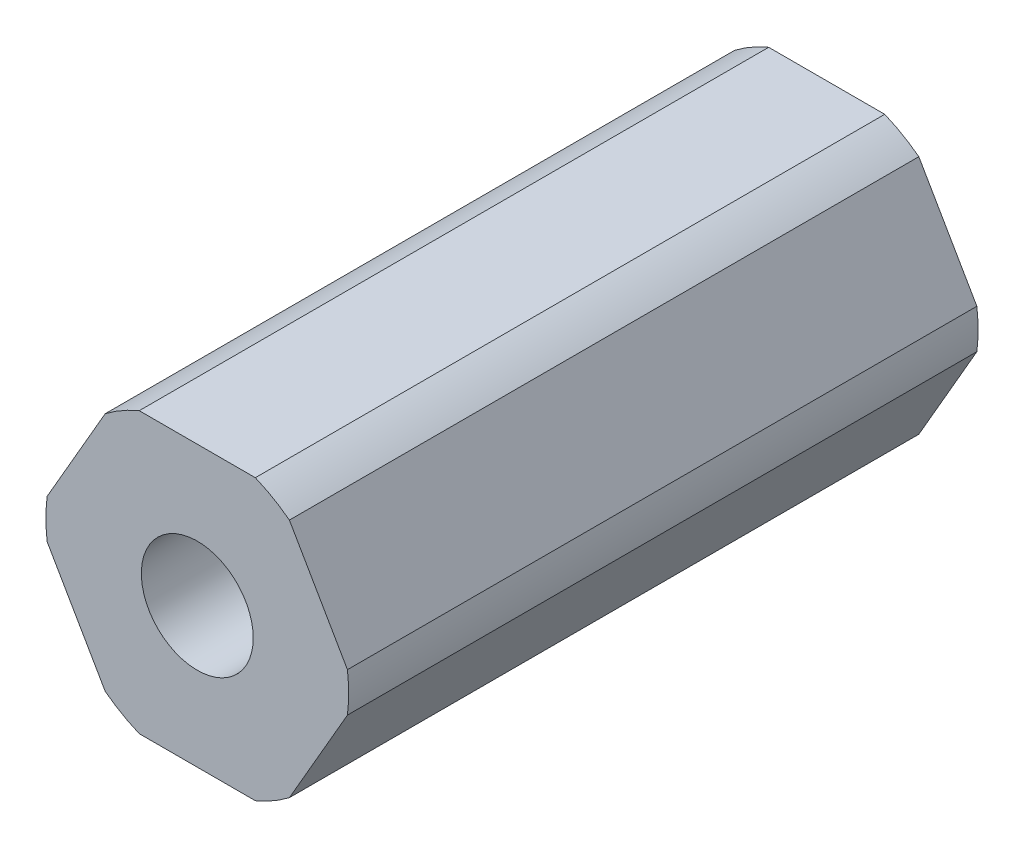
ISO-10303-21;
HEADER;
FILE_DESCRIPTION(('STEP AP214'),'2;1');
FILE_NAME('part.step','',(''),(''),'','','');
FILE_SCHEMA(('AUTOMOTIVE_DESIGN { 1 0 10303 214 1 1 1 1 }'));
ENDSEC;
DATA;
#1=APPLICATION_CONTEXT('core data for automotive mechanical design processes');
#2=APPLICATION_PROTOCOL_DEFINITION('international standard','automotive_design',2000,#1);
#3=PRODUCT_CONTEXT('',#1,'mechanical');
#4=PRODUCT('Part','Part','',(#3));
#5=PRODUCT_RELATED_PRODUCT_CATEGORY('part','',(#4));
#6=PRODUCT_DEFINITION_FORMATION('','',#4);
#7=PRODUCT_DEFINITION_CONTEXT('part definition',#1,'design');
#8=PRODUCT_DEFINITION('design','',#6,#7);
#9=PRODUCT_DEFINITION_SHAPE('','',#8);
#10=(LENGTH_UNIT() NAMED_UNIT(*) SI_UNIT(.MILLI.,.METRE.));
#11=(NAMED_UNIT(*) PLANE_ANGLE_UNIT() SI_UNIT($,.RADIAN.));
#12=(NAMED_UNIT(*) SI_UNIT($,.STERADIAN.) SOLID_ANGLE_UNIT());
#13=UNCERTAINTY_MEASURE_WITH_UNIT(LENGTH_MEASURE(1.E-05),#10,'distance_accuracy_value','');
#14=(GEOMETRIC_REPRESENTATION_CONTEXT(3) GLOBAL_UNCERTAINTY_ASSIGNED_CONTEXT((#13)) GLOBAL_UNIT_ASSIGNED_CONTEXT((#10,
#11,#12)) REPRESENTATION_CONTEXT('',''));
#15=CARTESIAN_POINT('',(0.,0.,0.));
#16=DIRECTION('',(0.,0.,1.));
#17=DIRECTION('',(1.,0.,0.));
#18=AXIS2_PLACEMENT_3D('',#15,#16,#17);
#19=CARTESIAN_POINT('',(0.,0.,28.575));
#20=DIRECTION('',(0.,0.,1.));
#21=DIRECTION('',(1.,0.,0.));
#22=AXIS2_PLACEMENT_3D('',#19,#20,#21);
#23=PLANE('',#22);
#24=CARTESIAN_POINT('',(0.,0.,28.575));
#25=DIRECTION('',(0.,0.,1.));
#26=DIRECTION('',(1.,0.,0.));
#27=AXIS2_PLACEMENT_3D('',#24,#25,#26);
#28=CIRCLE('',#27,6.875);
#29=CARTESIAN_POINT('',(4.18177080173138,5.45696050579321,28.575));
#30=VERTEX_POINT('',#29);
#31=CARTESIAN_POINT('',(2.63498102459961,6.35,28.575));
#32=VERTEX_POINT('',#31);
#33=EDGE_CURVE('E178',#30,#32,#28,.T.);
#34=ORIENTED_EDGE('',*,*,#33,.T.);
#35=DIRECTION('',(-1.,0.,0.));
#36=VECTOR('',#35,1.);
#37=CARTESIAN_POINT('',(2.63498102459961,6.35,28.575));
#38=LINE('',#37,#36);
#39=CARTESIAN_POINT('',(-2.63498102459961,6.35,28.575));
#40=VERTEX_POINT('',#39);
#41=EDGE_CURVE('E106',#32,#40,#38,.T.);
#42=ORIENTED_EDGE('',*,*,#41,.T.);
#43=CARTESIAN_POINT('',(0.,0.,28.575));
#44=DIRECTION('',(0.,0.,1.));
#45=DIRECTION('',(1.,0.,0.));
#46=AXIS2_PLACEMENT_3D('',#43,#44,#45);
#47=CIRCLE('',#46,6.875);
#48=CARTESIAN_POINT('',(-4.18177080173138,5.45696050579321,28.575));
#49=VERTEX_POINT('',#48);
#50=EDGE_CURVE('E205',#40,#49,#47,.T.);
#51=ORIENTED_EDGE('',*,*,#50,.T.);
#52=DIRECTION('',(-0.5,-0.866025403784439,0.));
#53=VECTOR('',#52,1.);
#54=CARTESIAN_POINT('',(-4.18177080173138,5.45696050579321,28.575));
#55=LINE('',#54,#53);
#56=CARTESIAN_POINT('',(-6.81675182633099,0.893039494206786,28.575));
#57=VERTEX_POINT('',#56);
#58=EDGE_CURVE('E224',#49,#57,#55,.T.);
#59=ORIENTED_EDGE('',*,*,#58,.T.);
#60=CARTESIAN_POINT('',(0.,0.,28.575));
#61=DIRECTION('',(0.,0.,1.));
#62=DIRECTION('',(1.,0.,0.));
#63=AXIS2_PLACEMENT_3D('',#60,#61,#62);
#64=CIRCLE('',#63,6.875);
#65=CARTESIAN_POINT('',(-6.81675182633099,-0.893039494206779,28.575));
#66=VERTEX_POINT('',#65);
#67=EDGE_CURVE('E221',#57,#66,#64,.T.);
#68=ORIENTED_EDGE('',*,*,#67,.T.);
#69=DIRECTION('',(0.5,-0.866025403784439,0.));
#70=VECTOR('',#69,1.);
#71=CARTESIAN_POINT('',(-6.81675182633099,-0.893039494206781,28.575));
#72=LINE('',#71,#70);
#73=CARTESIAN_POINT('',(-4.18177080173138,-5.45696050579321,28.575));
#74=VERTEX_POINT('',#73);
#75=EDGE_CURVE('E223',#66,#74,#72,.T.);
#76=ORIENTED_EDGE('',*,*,#75,.T.);
#77=CARTESIAN_POINT('',(0.,0.,28.575));
#78=DIRECTION('',(0.,0.,1.));
#79=DIRECTION('',(1.,0.,0.));
#80=AXIS2_PLACEMENT_3D('',#77,#78,#79);
#81=CIRCLE('',#80,6.875);
#82=CARTESIAN_POINT('',(-2.63498102459962,-6.35,28.575));
#83=VERTEX_POINT('',#82);
#84=EDGE_CURVE('E226',#74,#83,#81,.T.);
#85=ORIENTED_EDGE('',*,*,#84,.T.);
#86=DIRECTION('',(1.,0.,0.));
#87=VECTOR('',#86,1.);
#88=CARTESIAN_POINT('',(-2.63498102459962,-6.35,28.575));
#89=LINE('',#88,#87);
#90=CARTESIAN_POINT('',(2.63498102459962,-6.35,28.575));
#91=VERTEX_POINT('',#90);
#92=EDGE_CURVE('E232',#83,#91,#89,.T.);
#93=ORIENTED_EDGE('',*,*,#92,.T.);
#94=CARTESIAN_POINT('',(0.,0.,28.575));
#95=DIRECTION('',(0.,0.,1.));
#96=DIRECTION('',(1.,0.,0.));
#97=AXIS2_PLACEMENT_3D('',#94,#95,#96);
#98=CIRCLE('',#97,6.875);
#99=CARTESIAN_POINT('',(4.18177080173138,-5.45696050579321,28.575));
#100=VERTEX_POINT('',#99);
#101=EDGE_CURVE('E137',#91,#100,#98,.T.);
#102=ORIENTED_EDGE('',*,*,#101,.T.);
#103=DIRECTION('',(0.5,0.866025403784439,0.));
#104=VECTOR('',#103,1.);
#105=CARTESIAN_POINT('',(4.18177080173138,-5.45696050579321,28.575));
#106=LINE('',#105,#104);
#107=CARTESIAN_POINT('',(6.81675182633099,-0.893039494206784,28.575));
#108=VERTEX_POINT('',#107);
#109=EDGE_CURVE('E131',#100,#108,#106,.T.);
#110=ORIENTED_EDGE('',*,*,#109,.T.);
#111=CARTESIAN_POINT('',(0.,0.,28.575));
#112=DIRECTION('',(0.,0.,1.));
#113=DIRECTION('',(1.,0.,0.));
#114=AXIS2_PLACEMENT_3D('',#111,#112,#113);
#115=CIRCLE('',#114,6.875);
#116=CARTESIAN_POINT('',(6.81675182633099,0.893039494206786,28.575));
#117=VERTEX_POINT('',#116);
#118=EDGE_CURVE('E135',#108,#117,#115,.T.);
#119=ORIENTED_EDGE('',*,*,#118,.T.);
#120=DIRECTION('',(-0.5,0.866025403784439,0.));
#121=VECTOR('',#120,1.);
#122=CARTESIAN_POINT('',(6.81675182633099,0.893039494206787,28.575));
#123=LINE('',#122,#121);
#124=EDGE_CURVE('E51',#117,#30,#123,.T.);
#125=ORIENTED_EDGE('',*,*,#124,.T.);
#126=EDGE_LOOP('',(#34,#42,#51,#59,#68,#76,#85,#93,#102,#110,#119,#125));
#127=FACE_BOUND('',#126,.T.);
#128=CARTESIAN_POINT('',(0.,0.,28.575));
#129=DIRECTION('',(0.,0.,1.));
#130=DIRECTION('',(1.,0.,0.));
#131=AXIS2_PLACEMENT_3D('',#128,#129,#130);
#132=CIRCLE('',#131,2.54);
#133=CARTESIAN_POINT('',(2.54,0.,28.575));
#134=VERTEX_POINT('',#133);
#135=EDGE_CURVE('E159',#134,#134,#132,.T.);
#136=ORIENTED_EDGE('',*,*,#135,.F.);
#137=EDGE_LOOP('',(#136));
#138=FACE_BOUND('',#137,.T.);
#139=ADVANCED_FACE('F34',(#127,#138),#23,.T.);
#140=CARTESIAN_POINT('',(0.,0.,0.));
#141=DIRECTION('',(0.,0.,1.));
#142=DIRECTION('',(1.,0.,0.));
#143=AXIS2_PLACEMENT_3D('',#140,#141,#142);
#144=PLANE('',#143);
#145=CARTESIAN_POINT('',(0.,0.,0.));
#146=DIRECTION('',(0.,0.,1.));
#147=DIRECTION('',(1.,0.,0.));
#148=AXIS2_PLACEMENT_3D('',#145,#146,#147);
#149=CIRCLE('',#148,6.875);
#150=CARTESIAN_POINT('',(4.18177080173138,5.45696050579321,0.));
#151=VERTEX_POINT('',#150);
#152=CARTESIAN_POINT('',(2.63498102459961,6.35,0.));
#153=VERTEX_POINT('',#152);
#154=EDGE_CURVE('E155',#151,#153,#149,.T.);
#155=ORIENTED_EDGE('',*,*,#154,.F.);
#156=DIRECTION('',(-0.5,0.866025403784439,0.));
#157=VECTOR('',#156,1.);
#158=CARTESIAN_POINT('',(6.81675182633099,0.893039494206787,0.));
#159=LINE('',#158,#157);
#160=CARTESIAN_POINT('',(6.81675182633099,0.893039494206786,0.));
#161=VERTEX_POINT('',#160);
#162=EDGE_CURVE('E98',#161,#151,#159,.T.);
#163=ORIENTED_EDGE('',*,*,#162,.F.);
#164=CARTESIAN_POINT('',(0.,0.,0.));
#165=DIRECTION('',(0.,0.,1.));
#166=DIRECTION('',(1.,0.,0.));
#167=AXIS2_PLACEMENT_3D('',#164,#165,#166);
#168=CIRCLE('',#167,6.875);
#169=CARTESIAN_POINT('',(6.81675182633099,-0.893039494206784,0.));
#170=VERTEX_POINT('',#169);
#171=EDGE_CURVE('E92',#170,#161,#168,.T.);
#172=ORIENTED_EDGE('',*,*,#171,.F.);
#173=DIRECTION('',(0.5,0.866025403784439,0.));
#174=VECTOR('',#173,1.);
#175=CARTESIAN_POINT('',(4.18177080173138,-5.45696050579321,0.));
#176=LINE('',#175,#174);
#177=CARTESIAN_POINT('',(4.18177080173138,-5.45696050579321,0.));
#178=VERTEX_POINT('',#177);
#179=EDGE_CURVE('E145',#178,#170,#176,.T.);
#180=ORIENTED_EDGE('',*,*,#179,.F.);
#181=CARTESIAN_POINT('',(0.,0.,0.));
#182=DIRECTION('',(0.,0.,1.));
#183=DIRECTION('',(1.,0.,0.));
#184=AXIS2_PLACEMENT_3D('',#181,#182,#183);
#185=CIRCLE('',#184,6.875);
#186=CARTESIAN_POINT('',(2.63498102459962,-6.35,0.));
#187=VERTEX_POINT('',#186);
#188=EDGE_CURVE('E173',#187,#178,#185,.T.);
#189=ORIENTED_EDGE('',*,*,#188,.F.);
#190=DIRECTION('',(1.,0.,0.));
#191=VECTOR('',#190,1.);
#192=CARTESIAN_POINT('',(-2.63498102459962,-6.35,0.));
#193=LINE('',#192,#191);
#194=CARTESIAN_POINT('',(-2.63498102459962,-6.35,0.));
#195=VERTEX_POINT('',#194);
#196=EDGE_CURVE('E171',#195,#187,#193,.T.);
#197=ORIENTED_EDGE('',*,*,#196,.F.);
#198=CARTESIAN_POINT('',(0.,0.,0.));
#199=DIRECTION('',(0.,0.,1.));
#200=DIRECTION('',(1.,0.,0.));
#201=AXIS2_PLACEMENT_3D('',#198,#199,#200);
#202=CIRCLE('',#201,6.875);
#203=CARTESIAN_POINT('',(-4.18177080173138,-5.45696050579321,0.));
#204=VERTEX_POINT('',#203);
#205=EDGE_CURVE('E169',#204,#195,#202,.T.);
#206=ORIENTED_EDGE('',*,*,#205,.F.);
#207=DIRECTION('',(0.5,-0.866025403784439,0.));
#208=VECTOR('',#207,1.);
#209=CARTESIAN_POINT('',(-6.81675182633099,-0.893039494206781,0.));
#210=LINE('',#209,#208);
#211=CARTESIAN_POINT('',(-6.81675182633099,-0.893039494206779,0.));
#212=VERTEX_POINT('',#211);
#213=EDGE_CURVE('E167',#212,#204,#210,.T.);
#214=ORIENTED_EDGE('',*,*,#213,.F.);
#215=CARTESIAN_POINT('',(0.,0.,0.));
#216=DIRECTION('',(0.,0.,1.));
#217=DIRECTION('',(1.,0.,0.));
#218=AXIS2_PLACEMENT_3D('',#215,#216,#217);
#219=CIRCLE('',#218,6.875);
#220=CARTESIAN_POINT('',(-6.81675182633099,0.893039494206786,0.));
#221=VERTEX_POINT('',#220);
#222=EDGE_CURVE('E165',#221,#212,#219,.T.);
#223=ORIENTED_EDGE('',*,*,#222,.F.);
#224=DIRECTION('',(-0.5,-0.866025403784439,0.));
#225=VECTOR('',#224,1.);
#226=CARTESIAN_POINT('',(-4.18177080173138,5.45696050579321,0.));
#227=LINE('',#226,#225);
#228=CARTESIAN_POINT('',(-4.18177080173138,5.45696050579321,0.));
#229=VERTEX_POINT('',#228);
#230=EDGE_CURVE('E163',#229,#221,#227,.T.);
#231=ORIENTED_EDGE('',*,*,#230,.F.);
#232=CARTESIAN_POINT('',(0.,0.,0.));
#233=DIRECTION('',(0.,0.,1.));
#234=DIRECTION('',(1.,0.,0.));
#235=AXIS2_PLACEMENT_3D('',#232,#233,#234);
#236=CIRCLE('',#235,6.875);
#237=CARTESIAN_POINT('',(-2.63498102459961,6.35,0.));
#238=VERTEX_POINT('',#237);
#239=EDGE_CURVE('E161',#238,#229,#236,.T.);
#240=ORIENTED_EDGE('',*,*,#239,.F.);
#241=DIRECTION('',(-1.,0.,0.));
#242=VECTOR('',#241,1.);
#243=CARTESIAN_POINT('',(2.63498102459961,6.35,0.));
#244=LINE('',#243,#242);
#245=EDGE_CURVE('E158',#153,#238,#244,.T.);
#246=ORIENTED_EDGE('',*,*,#245,.F.);
#247=EDGE_LOOP('',(#155,#163,#172,#180,#189,#197,#206,#214,#223,#231,#240,#246));
#248=FACE_BOUND('',#247,.T.);
#249=CARTESIAN_POINT('',(0.,0.,0.));
#250=DIRECTION('',(0.,0.,1.));
#251=DIRECTION('',(1.,0.,0.));
#252=AXIS2_PLACEMENT_3D('',#249,#250,#251);
#253=CIRCLE('',#252,2.54);
#254=CARTESIAN_POINT('',(2.54,0.,0.));
#255=VERTEX_POINT('',#254);
#256=EDGE_CURVE('E391',#255,#255,#253,.T.);
#257=ORIENTED_EDGE('',*,*,#256,.T.);
#258=EDGE_LOOP('',(#257));
#259=FACE_BOUND('',#258,.T.);
#260=ADVANCED_FACE('F209',(#248,#259),#144,.F.);
#261=CARTESIAN_POINT('',(0.,0.,28.575));
#262=DIRECTION('',(0.,0.,-1.));
#263=DIRECTION('',(-1.,0.,0.));
#264=AXIS2_PLACEMENT_3D('',#261,#262,#263);
#265=CYLINDRICAL_SURFACE('',#264,6.875);
#266=ORIENTED_EDGE('',*,*,#154,.T.);
#267=DIRECTION('',(0.,0.,-1.));
#268=VECTOR('',#267,1.);
#269=CARTESIAN_POINT('',(2.63498102459961,6.35,28.575));
#270=LINE('',#269,#268);
#271=EDGE_CURVE('E11',#32,#153,#270,.T.);
#272=ORIENTED_EDGE('',*,*,#271,.F.);
#273=ORIENTED_EDGE('',*,*,#33,.F.);
#274=DIRECTION('',(0.,0.,-1.));
#275=VECTOR('',#274,1.);
#276=CARTESIAN_POINT('',(4.18177080173138,5.45696050579321,28.575));
#277=LINE('',#276,#275);
#278=EDGE_CURVE('E151',#30,#151,#277,.T.);
#279=ORIENTED_EDGE('',*,*,#278,.T.);
#280=EDGE_LOOP('',(#266,#272,#273,#279));
#281=FACE_BOUND('',#280,.T.);
#282=ADVANCED_FACE('F36',(#281),#265,.T.);
#283=CARTESIAN_POINT('',(2.63498102459961,6.35,28.575));
#284=DIRECTION('',(0.,-1.,0.));
#285=DIRECTION('',(0.,0.,-1.));
#286=AXIS2_PLACEMENT_3D('',#283,#284,#285);
#287=PLANE('',#286);
#288=ORIENTED_EDGE('',*,*,#245,.T.);
#289=DIRECTION('',(0.,0.,-1.));
#290=VECTOR('',#289,1.);
#291=CARTESIAN_POINT('',(-2.63498102459961,6.35,28.575));
#292=LINE('',#291,#290);
#293=EDGE_CURVE('E43',#40,#238,#292,.T.);
#294=ORIENTED_EDGE('',*,*,#293,.F.);
#295=ORIENTED_EDGE('',*,*,#41,.F.);
#296=ORIENTED_EDGE('',*,*,#271,.T.);
#297=EDGE_LOOP('',(#288,#294,#295,#296));
#298=FACE_BOUND('',#297,.T.);
#299=ADVANCED_FACE('F266',(#298),#287,.F.);
#300=CARTESIAN_POINT('',(0.,0.,28.575));
#301=DIRECTION('',(0.,0.,-1.));
#302=DIRECTION('',(-1.,0.,0.));
#303=AXIS2_PLACEMENT_3D('',#300,#301,#302);
#304=CYLINDRICAL_SURFACE('',#303,6.875);
#305=ORIENTED_EDGE('',*,*,#239,.T.);
#306=DIRECTION('',(0.,0.,-1.));
#307=VECTOR('',#306,1.);
#308=CARTESIAN_POINT('',(-4.18177080173138,5.45696050579321,28.575));
#309=LINE('',#308,#307);
#310=EDGE_CURVE('E197',#49,#229,#309,.T.);
#311=ORIENTED_EDGE('',*,*,#310,.F.);
#312=ORIENTED_EDGE('',*,*,#50,.F.);
#313=ORIENTED_EDGE('',*,*,#293,.T.);
#314=EDGE_LOOP('',(#305,#311,#312,#313));
#315=FACE_BOUND('',#314,.T.);
#316=ADVANCED_FACE('F203',(#315),#304,.T.);
#317=CARTESIAN_POINT('',(-4.18177080173138,5.45696050579321,28.575));
#318=DIRECTION('',(0.866025403784438,-0.5,0.));
#319=DIRECTION('',(0.5,0.866025403784439,0.));
#320=AXIS2_PLACEMENT_3D('',#317,#318,#319);
#321=PLANE('',#320);
#322=ORIENTED_EDGE('',*,*,#230,.T.);
#323=DIRECTION('',(0.,0.,-1.));
#324=VECTOR('',#323,1.);
#325=CARTESIAN_POINT('',(-6.81675182633099,0.893039494206786,28.575));
#326=LINE('',#325,#324);
#327=EDGE_CURVE('E194',#57,#221,#326,.T.);
#328=ORIENTED_EDGE('',*,*,#327,.F.);
#329=ORIENTED_EDGE('',*,*,#58,.F.);
#330=ORIENTED_EDGE('',*,*,#310,.T.);
#331=EDGE_LOOP('',(#322,#328,#329,#330));
#332=FACE_BOUND('',#331,.T.);
#333=ADVANCED_FACE('F215',(#332),#321,.F.);
#334=CARTESIAN_POINT('',(0.,0.,28.575));
#335=DIRECTION('',(0.,0.,-1.));
#336=DIRECTION('',(-1.,0.,0.));
#337=AXIS2_PLACEMENT_3D('',#334,#335,#336);
#338=CYLINDRICAL_SURFACE('',#337,6.875);
#339=ORIENTED_EDGE('',*,*,#222,.T.);
#340=DIRECTION('',(0.,0.,-1.));
#341=VECTOR('',#340,1.);
#342=CARTESIAN_POINT('',(-6.81675182633099,-0.893039494206779,28.575));
#343=LINE('',#342,#341);
#344=EDGE_CURVE('E191',#66,#212,#343,.T.);
#345=ORIENTED_EDGE('',*,*,#344,.F.);
#346=ORIENTED_EDGE('',*,*,#67,.F.);
#347=ORIENTED_EDGE('',*,*,#327,.T.);
#348=EDGE_LOOP('',(#339,#345,#346,#347));
#349=FACE_BOUND('',#348,.T.);
#350=ADVANCED_FACE('F219',(#349),#338,.T.);
#351=CARTESIAN_POINT('',(-6.81675182633099,-0.893039494206781,28.575));
#352=DIRECTION('',(0.866025403784439,0.5,0.));
#353=DIRECTION('',(-0.5,0.866025403784439,0.));
#354=AXIS2_PLACEMENT_3D('',#351,#352,#353);
#355=PLANE('',#354);
#356=ORIENTED_EDGE('',*,*,#213,.T.);
#357=DIRECTION('',(0.,0.,-1.));
#358=VECTOR('',#357,1.);
#359=CARTESIAN_POINT('',(-4.18177080173138,-5.45696050579321,28.575));
#360=LINE('',#359,#358);
#361=EDGE_CURVE('E188',#74,#204,#360,.T.);
#362=ORIENTED_EDGE('',*,*,#361,.F.);
#363=ORIENTED_EDGE('',*,*,#75,.F.);
#364=ORIENTED_EDGE('',*,*,#344,.T.);
#365=EDGE_LOOP('',(#356,#362,#363,#364));
#366=FACE_BOUND('',#365,.T.);
#367=ADVANCED_FACE('F279',(#366),#355,.F.);
#368=CARTESIAN_POINT('',(0.,0.,28.575));
#369=DIRECTION('',(0.,0.,-1.));
#370=DIRECTION('',(-1.,0.,0.));
#371=AXIS2_PLACEMENT_3D('',#368,#369,#370);
#372=CYLINDRICAL_SURFACE('',#371,6.875);
#373=ORIENTED_EDGE('',*,*,#205,.T.);
#374=DIRECTION('',(0.,0.,-1.));
#375=VECTOR('',#374,1.);
#376=CARTESIAN_POINT('',(-2.63498102459962,-6.35,28.575));
#377=LINE('',#376,#375);
#378=EDGE_CURVE('E185',#83,#195,#377,.T.);
#379=ORIENTED_EDGE('',*,*,#378,.F.);
#380=ORIENTED_EDGE('',*,*,#84,.F.);
#381=ORIENTED_EDGE('',*,*,#361,.T.);
#382=EDGE_LOOP('',(#373,#379,#380,#381));
#383=FACE_BOUND('',#382,.T.);
#384=ADVANCED_FACE('F282',(#383),#372,.T.);
#385=CARTESIAN_POINT('',(-2.63498102459962,-6.35,28.575));
#386=DIRECTION('',(0.,1.,0.));
#387=DIRECTION('',(-1.,0.,0.));
#388=AXIS2_PLACEMENT_3D('',#385,#386,#387);
#389=PLANE('',#388);
#390=ORIENTED_EDGE('',*,*,#196,.T.);
#391=DIRECTION('',(0.,0.,-1.));
#392=VECTOR('',#391,1.);
#393=CARTESIAN_POINT('',(2.63498102459962,-6.35,28.575));
#394=LINE('',#393,#392);
#395=EDGE_CURVE('E182',#91,#187,#394,.T.);
#396=ORIENTED_EDGE('',*,*,#395,.F.);
#397=ORIENTED_EDGE('',*,*,#92,.F.);
#398=ORIENTED_EDGE('',*,*,#378,.T.);
#399=EDGE_LOOP('',(#390,#396,#397,#398));
#400=FACE_BOUND('',#399,.T.);
#401=ADVANCED_FACE('F238',(#400),#389,.F.);
#402=CARTESIAN_POINT('',(0.,0.,28.575));
#403=DIRECTION('',(0.,0.,-1.));
#404=DIRECTION('',(-1.,0.,0.));
#405=AXIS2_PLACEMENT_3D('',#402,#403,#404);
#406=CYLINDRICAL_SURFACE('',#405,6.875);
#407=ORIENTED_EDGE('',*,*,#188,.T.);
#408=DIRECTION('',(0.,0.,-1.));
#409=VECTOR('',#408,1.);
#410=CARTESIAN_POINT('',(4.18177080173138,-5.45696050579321,28.575));
#411=LINE('',#410,#409);
#412=EDGE_CURVE('E146',#100,#178,#411,.T.);
#413=ORIENTED_EDGE('',*,*,#412,.F.);
#414=ORIENTED_EDGE('',*,*,#101,.F.);
#415=ORIENTED_EDGE('',*,*,#395,.T.);
#416=EDGE_LOOP('',(#407,#413,#414,#415));
#417=FACE_BOUND('',#416,.T.);
#418=ADVANCED_FACE('F242',(#417),#406,.T.);
#419=CARTESIAN_POINT('',(4.18177080173138,-5.45696050579321,28.575));
#420=DIRECTION('',(-0.866025403784439,0.5,0.));
#421=DIRECTION('',(-0.5,-0.866025403784439,0.));
#422=AXIS2_PLACEMENT_3D('',#419,#420,#421);
#423=PLANE('',#422);
#424=ORIENTED_EDGE('',*,*,#179,.T.);
#425=DIRECTION('',(0.,0.,-1.));
#426=VECTOR('',#425,1.);
#427=CARTESIAN_POINT('',(6.81675182633099,-0.893039494206784,28.575));
#428=LINE('',#427,#426);
#429=EDGE_CURVE('E142',#108,#170,#428,.T.);
#430=ORIENTED_EDGE('',*,*,#429,.F.);
#431=ORIENTED_EDGE('',*,*,#109,.F.);
#432=ORIENTED_EDGE('',*,*,#412,.T.);
#433=EDGE_LOOP('',(#424,#430,#431,#432));
#434=FACE_BOUND('',#433,.T.);
#435=ADVANCED_FACE('F143',(#434),#423,.F.);
#436=CARTESIAN_POINT('',(0.,0.,28.575));
#437=DIRECTION('',(0.,0.,-1.));
#438=DIRECTION('',(-1.,0.,0.));
#439=AXIS2_PLACEMENT_3D('',#436,#437,#438);
#440=CYLINDRICAL_SURFACE('',#439,6.875);
#441=ORIENTED_EDGE('',*,*,#171,.T.);
#442=DIRECTION('',(0.,0.,-1.));
#443=VECTOR('',#442,1.);
#444=CARTESIAN_POINT('',(6.81675182633099,0.893039494206786,28.575));
#445=LINE('',#444,#443);
#446=EDGE_CURVE('E147',#117,#161,#445,.T.);
#447=ORIENTED_EDGE('',*,*,#446,.F.);
#448=ORIENTED_EDGE('',*,*,#118,.F.);
#449=ORIENTED_EDGE('',*,*,#429,.T.);
#450=EDGE_LOOP('',(#441,#447,#448,#449));
#451=FACE_BOUND('',#450,.T.);
#452=ADVANCED_FACE('F149',(#451),#440,.T.);
#453=CARTESIAN_POINT('',(6.81675182633099,0.893039494206787,28.575));
#454=DIRECTION('',(-0.866025403784439,-0.5,0.));
#455=DIRECTION('',(0.5,-0.866025403784439,0.));
#456=AXIS2_PLACEMENT_3D('',#453,#454,#455);
#457=PLANE('',#456);
#458=ORIENTED_EDGE('',*,*,#162,.T.);
#459=ORIENTED_EDGE('',*,*,#278,.F.);
#460=ORIENTED_EDGE('',*,*,#124,.F.);
#461=ORIENTED_EDGE('',*,*,#446,.T.);
#462=EDGE_LOOP('',(#458,#459,#460,#461));
#463=FACE_BOUND('',#462,.T.);
#464=ADVANCED_FACE('F246',(#463),#457,.F.);
#465=CARTESIAN_POINT('',(0.,0.,28.575));
#466=DIRECTION('',(0.,0.,-1.));
#467=DIRECTION('',(-1.,0.,0.));
#468=AXIS2_PLACEMENT_3D('',#465,#466,#467);
#469=CYLINDRICAL_SURFACE('',#468,2.54);
#470=ORIENTED_EDGE('',*,*,#135,.T.);
#471=EDGE_LOOP('',(#470));
#472=FACE_BOUND('',#471,.T.);
#473=ORIENTED_EDGE('',*,*,#256,.F.);
#474=EDGE_LOOP('',(#473));
#475=FACE_BOUND('',#474,.T.);
#476=ADVANCED_FACE('F248',(#472,#475),#469,.F.);
#477=CLOSED_SHELL('',(#139,#260,#282,#299,#316,#333,#350,#367,#384,#401,#418,#435,#452,#464,#476));
#478=MANIFOLD_SOLID_BREP('B2',#477);
#479=ADVANCED_BREP_SHAPE_REPRESENTATION('',(#18,#478),#14);
#480=SHAPE_DEFINITION_REPRESENTATION(#9,#479);
ENDSEC;
END-ISO-10303-21;
